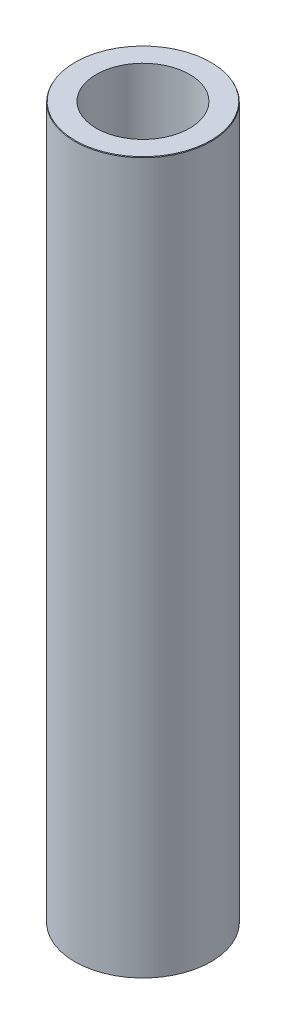
ISO-10303-21;
HEADER;
FILE_DESCRIPTION(('STEP AP214'),'2;1');
FILE_NAME('part.step','',(''),(''),'','','');
FILE_SCHEMA(('AUTOMOTIVE_DESIGN { 1 0 10303 214 1 1 1 1 }'));
ENDSEC;
DATA;
#1=APPLICATION_CONTEXT('core data for automotive mechanical design processes');
#2=APPLICATION_PROTOCOL_DEFINITION('international standard','automotive_design',2000,#1);
#3=PRODUCT_CONTEXT('',#1,'mechanical');
#4=PRODUCT('Part','Part','',(#3));
#5=PRODUCT_RELATED_PRODUCT_CATEGORY('part','',(#4));
#6=PRODUCT_DEFINITION_FORMATION('','',#4);
#7=PRODUCT_DEFINITION_CONTEXT('part definition',#1,'design');
#8=PRODUCT_DEFINITION('design','',#6,#7);
#9=PRODUCT_DEFINITION_SHAPE('','',#8);
#10=(LENGTH_UNIT() NAMED_UNIT(*) SI_UNIT(.MILLI.,.METRE.));
#11=(NAMED_UNIT(*) PLANE_ANGLE_UNIT() SI_UNIT($,.RADIAN.));
#12=(NAMED_UNIT(*) SI_UNIT($,.STERADIAN.) SOLID_ANGLE_UNIT());
#13=UNCERTAINTY_MEASURE_WITH_UNIT(LENGTH_MEASURE(1.E-05),#10,'distance_accuracy_value','');
#14=(GEOMETRIC_REPRESENTATION_CONTEXT(3) GLOBAL_UNCERTAINTY_ASSIGNED_CONTEXT((#13)) GLOBAL_UNIT_ASSIGNED_CONTEXT((#10,
#11,#12)) REPRESENTATION_CONTEXT('',''));
#15=CARTESIAN_POINT('',(0.,0.,0.));
#16=DIRECTION('',(0.,0.,1.));
#17=DIRECTION('',(1.,0.,0.));
#18=AXIS2_PLACEMENT_3D('',#15,#16,#17);
#19=CARTESIAN_POINT('',(0.,600.,0.));
#20=DIRECTION('',(0.,-1.,0.));
#21=DIRECTION('',(0.,0.,-1.));
#22=AXIS2_PLACEMENT_3D('',#19,#20,#21);
#23=CYLINDRICAL_SURFACE('',#22,57.5);
#24=CARTESIAN_POINT('',(0.,599.420908374999,0.));
#25=DIRECTION('',(0.,1.,0.));
#26=DIRECTION('',(0.,0.,1.));
#27=AXIS2_PLACEMENT_3D('',#24,#25,#26);
#28=CIRCLE('',#27,57.5);
#29=CARTESIAN_POINT('',(0.,599.420908374999,57.5));
#30=VERTEX_POINT('',#29);
#31=EDGE_CURVE('E50',#30,#30,#28,.F.);
#32=ORIENTED_EDGE('',*,*,#31,.T.);
#33=EDGE_LOOP('',(#32));
#34=FACE_BOUND('',#33,.T.);
#35=CARTESIAN_POINT('',(0.,0.334338705579307,0.));
#36=DIRECTION('',(0.,1.,0.));
#37=DIRECTION('',(0.,0.,1.));
#38=AXIS2_PLACEMENT_3D('',#35,#36,#37);
#39=CIRCLE('',#38,57.5);
#40=CARTESIAN_POINT('',(0.,0.334338705579307,57.5));
#41=VERTEX_POINT('',#40);
#42=EDGE_CURVE('E51',#41,#41,#39,.T.);
#43=ORIENTED_EDGE('',*,*,#42,.T.);
#44=EDGE_LOOP('',(#43));
#45=FACE_BOUND('',#44,.T.);
#46=ADVANCED_FACE('F39',(#34,#45),#23,.T.);
#47=CARTESIAN_POINT('',(0.,600.,0.));
#48=DIRECTION('',(0.,1.,0.));
#49=DIRECTION('',(0.,0.,1.));
#50=AXIS2_PLACEMENT_3D('',#47,#48,#49);
#51=PLANE('',#50);
#52=CARTESIAN_POINT('',(0.,600.,0.));
#53=DIRECTION('',(0.,1.,0.));
#54=DIRECTION('',(0.,0.,1.));
#55=AXIS2_PLACEMENT_3D('',#52,#53,#54);
#56=CIRCLE('',#55,57.1656612944206);
#57=CARTESIAN_POINT('',(0.,600.,57.1656612944206));
#58=VERTEX_POINT('',#57);
#59=EDGE_CURVE('E54',#58,#58,#56,.T.);
#60=ORIENTED_EDGE('',*,*,#59,.T.);
#61=EDGE_LOOP('',(#60));
#62=FACE_BOUND('',#61,.T.);
#63=CARTESIAN_POINT('',(0.,600.,0.));
#64=DIRECTION('',(0.,1.,0.));
#65=DIRECTION('',(0.,0.,1.));
#66=AXIS2_PLACEMENT_3D('',#63,#64,#65);
#67=CIRCLE('',#66,39.3733739262744);
#68=CARTESIAN_POINT('',(0.,600.,39.3733739262744));
#69=VERTEX_POINT('',#68);
#70=EDGE_CURVE('E58',#69,#69,#67,.T.);
#71=ORIENTED_EDGE('',*,*,#70,.F.);
#72=EDGE_LOOP('',(#71));
#73=FACE_BOUND('',#72,.T.);
#74=ADVANCED_FACE('F69',(#62,#73),#51,.T.);
#75=CARTESIAN_POINT('',(0.,0.,0.));
#76=DIRECTION('',(0.,1.,0.));
#77=DIRECTION('',(0.,0.,1.));
#78=AXIS2_PLACEMENT_3D('',#75,#76,#77);
#79=PLANE('',#78);
#80=CARTESIAN_POINT('',(0.,0.,0.));
#81=DIRECTION('',(0.,1.,0.));
#82=DIRECTION('',(0.,0.,1.));
#83=AXIS2_PLACEMENT_3D('',#80,#81,#82);
#84=CIRCLE('',#83,56.9209083749998);
#85=CARTESIAN_POINT('',(0.,0.,56.9209083749998));
#86=VERTEX_POINT('',#85);
#87=EDGE_CURVE('E10',#86,#86,#84,.F.);
#88=ORIENTED_EDGE('',*,*,#87,.T.);
#89=EDGE_LOOP('',(#88));
#90=FACE_BOUND('',#89,.T.);
#91=CARTESIAN_POINT('',(0.,0.,0.));
#92=DIRECTION('',(0.,1.,0.));
#93=DIRECTION('',(0.,0.,1.));
#94=AXIS2_PLACEMENT_3D('',#91,#92,#93);
#95=CIRCLE('',#94,39.3733739262744);
#96=CARTESIAN_POINT('',(0.,0.,39.3733739262744));
#97=VERTEX_POINT('',#96);
#98=EDGE_CURVE('E63',#97,#97,#95,.T.);
#99=ORIENTED_EDGE('',*,*,#98,.T.);
#100=EDGE_LOOP('',(#99));
#101=FACE_BOUND('',#100,.T.);
#102=ADVANCED_FACE('F75',(#90,#101),#79,.F.);
#103=CARTESIAN_POINT('',(0.,600.,0.));
#104=DIRECTION('',(0.,-1.,0.));
#105=DIRECTION('',(0.,0.,-1.));
#106=AXIS2_PLACEMENT_3D('',#103,#104,#105);
#107=CYLINDRICAL_SURFACE('',#106,39.3733739262744);
#108=ORIENTED_EDGE('',*,*,#70,.T.);
#109=EDGE_LOOP('',(#108));
#110=FACE_BOUND('',#109,.T.);
#111=ORIENTED_EDGE('',*,*,#98,.F.);
#112=EDGE_LOOP('',(#111));
#113=FACE_BOUND('',#112,.T.);
#114=ADVANCED_FACE('F70',(#110,#113),#107,.F.);
#115=CARTESIAN_POINT('',(0.,600.,0.));
#116=DIRECTION('',(0.,-1.,0.));
#117=DIRECTION('',(0.,0.,-1.));
#118=AXIS2_PLACEMENT_3D('',#115,#116,#117);
#119=CONICAL_SURFACE('',#118,57.1656612944206,0.523598775598227);
#120=ORIENTED_EDGE('',*,*,#31,.F.);
#121=EDGE_LOOP('',(#120));
#122=FACE_BOUND('',#121,.T.);
#123=ORIENTED_EDGE('',*,*,#59,.F.);
#124=EDGE_LOOP('',(#123));
#125=FACE_BOUND('',#124,.T.);
#126=ADVANCED_FACE('F81',(#122,#125),#119,.T.);
#127=CARTESIAN_POINT('',(0.,0.334338705579307,0.));
#128=DIRECTION('',(0.,1.,0.));
#129=DIRECTION('',(0.,0.,1.));
#130=AXIS2_PLACEMENT_3D('',#127,#128,#129);
#131=CONICAL_SURFACE('',#130,57.5,1.04719755119663);
#132=ORIENTED_EDGE('',*,*,#87,.F.);
#133=EDGE_LOOP('',(#132));
#134=FACE_BOUND('',#133,.T.);
#135=ORIENTED_EDGE('',*,*,#42,.F.);
#136=EDGE_LOOP('',(#135));
#137=FACE_BOUND('',#136,.T.);
#138=ADVANCED_FACE('F45',(#134,#137),#131,.T.);
#139=CLOSED_SHELL('',(#46,#74,#102,#114,#126,#138));
#140=MANIFOLD_SOLID_BREP('B2',#139);
#141=ADVANCED_BREP_SHAPE_REPRESENTATION('',(#18,#140),#14);
#142=SHAPE_DEFINITION_REPRESENTATION(#9,#141);
ENDSEC;
END-ISO-10303-21;
